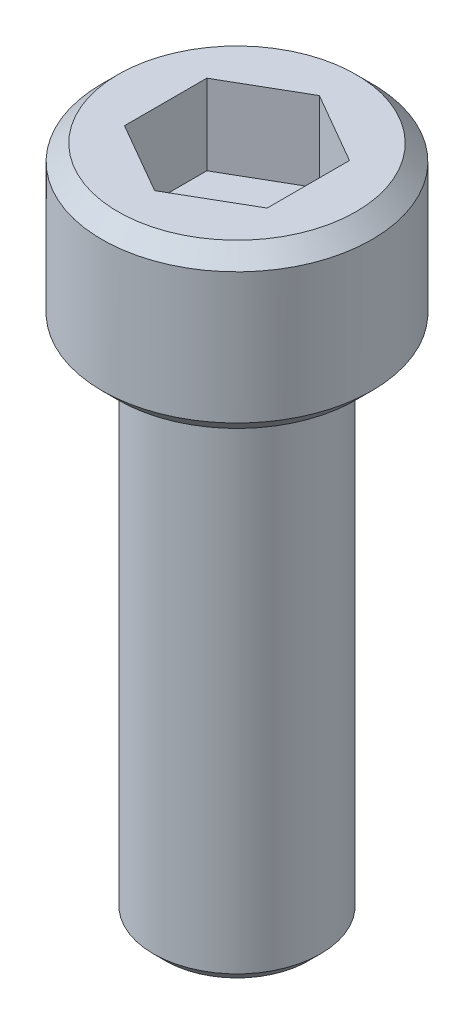
ISO-10303-21;
HEADER;
FILE_DESCRIPTION(('STEP AP214'),'2;1');
FILE_NAME('part.step','',(''),(''),'','','');
FILE_SCHEMA(('AUTOMOTIVE_DESIGN { 1 0 10303 214 1 1 1 1 }'));
ENDSEC;
DATA;
#1=APPLICATION_CONTEXT('core data for automotive mechanical design processes');
#2=APPLICATION_PROTOCOL_DEFINITION('international standard','automotive_design',2000,#1);
#3=PRODUCT_CONTEXT('',#1,'mechanical');
#4=PRODUCT('Part','Part','',(#3));
#5=PRODUCT_RELATED_PRODUCT_CATEGORY('part','',(#4));
#6=PRODUCT_DEFINITION_FORMATION('','',#4);
#7=PRODUCT_DEFINITION_CONTEXT('part definition',#1,'design');
#8=PRODUCT_DEFINITION('design','',#6,#7);
#9=PRODUCT_DEFINITION_SHAPE('','',#8);
#10=(LENGTH_UNIT() NAMED_UNIT(*) SI_UNIT(.MILLI.,.METRE.));
#11=(NAMED_UNIT(*) PLANE_ANGLE_UNIT() SI_UNIT($,.RADIAN.));
#12=(NAMED_UNIT(*) SI_UNIT($,.STERADIAN.) SOLID_ANGLE_UNIT());
#13=UNCERTAINTY_MEASURE_WITH_UNIT(LENGTH_MEASURE(1.E-05),#10,'distance_accuracy_value','');
#14=(GEOMETRIC_REPRESENTATION_CONTEXT(3) GLOBAL_UNCERTAINTY_ASSIGNED_CONTEXT((#13)) GLOBAL_UNIT_ASSIGNED_CONTEXT((#10,
#11,#12)) REPRESENTATION_CONTEXT('',''));
#15=CARTESIAN_POINT('',(0.,0.,0.));
#16=DIRECTION('',(0.,0.,1.));
#17=DIRECTION('',(1.,0.,0.));
#18=AXIS2_PLACEMENT_3D('',#15,#16,#17);
#19=CARTESIAN_POINT('',(1.778,2.06400000000001,3.07958633585748));
#20=DIRECTION('',(0.,1.,0.));
#21=DIRECTION('',(-1.,0.,0.));
#22=AXIS2_PLACEMENT_3D('',#19,#20,#21);
#23=PLANE('',#22);
#24=DIRECTION('',(-0.866025403784439,0.,0.5));
#25=VECTOR('',#24,1.);
#26=CARTESIAN_POINT('',(0.,2.06400000000001,-2.0530575572383));
#27=LINE('',#26,#25);
#28=CARTESIAN_POINT('',(0.,2.06400000000001,-2.0530575572383));
#29=VERTEX_POINT('',#28);
#30=CARTESIAN_POINT('',(-1.778,2.06400000000001,-1.02652877861914));
#31=VERTEX_POINT('',#30);
#32=EDGE_CURVE('E68',#29,#31,#27,.T.);
#33=ORIENTED_EDGE('',*,*,#32,.T.);
#34=DIRECTION('',(0.,0.,1.));
#35=VECTOR('',#34,1.);
#36=CARTESIAN_POINT('',(-1.778,2.06400000000001,-1.02652877861914));
#37=LINE('',#36,#35);
#38=CARTESIAN_POINT('',(-1.778,2.06400000000001,1.02652877861916));
#39=VERTEX_POINT('',#38);
#40=EDGE_CURVE('E70',#31,#39,#37,.T.);
#41=ORIENTED_EDGE('',*,*,#40,.T.);
#42=DIRECTION('',(0.866025403784439,0.,0.499999999999999));
#43=VECTOR('',#42,1.);
#44=CARTESIAN_POINT('',(-1.77799999999999,2.06400000000001,1.02652877861916));
#45=LINE('',#44,#43);
#46=CARTESIAN_POINT('',(0.,2.06400000000001,2.05305755723832));
#47=VERTEX_POINT('',#46);
#48=EDGE_CURVE('E72',#39,#47,#45,.T.);
#49=ORIENTED_EDGE('',*,*,#48,.T.);
#50=DIRECTION('',(0.866025403784438,0.,-0.500000000000001));
#51=VECTOR('',#50,1.);
#52=CARTESIAN_POINT('',(0.,2.06400000000001,2.05305755723831));
#53=LINE('',#52,#51);
#54=CARTESIAN_POINT('',(1.778,2.06400000000001,1.02652877861917));
#55=VERTEX_POINT('',#54);
#56=EDGE_CURVE('E127',#47,#55,#53,.T.);
#57=ORIENTED_EDGE('',*,*,#56,.T.);
#58=DIRECTION('',(0.,0.,-1.));
#59=VECTOR('',#58,1.);
#60=CARTESIAN_POINT('',(1.778,2.06400000000001,1.02652877861917));
#61=LINE('',#60,#59);
#62=CARTESIAN_POINT('',(1.778,2.06400000000001,-1.02652877861914));
#63=VERTEX_POINT('',#62);
#64=EDGE_CURVE('E132',#55,#63,#61,.T.);
#65=ORIENTED_EDGE('',*,*,#64,.T.);
#66=DIRECTION('',(-0.866025403784439,0.,-0.499999999999999));
#67=VECTOR('',#66,1.);
#68=CARTESIAN_POINT('',(1.77800000000001,2.06400000000001,-1.02652877861914));
#69=LINE('',#68,#67);
#70=EDGE_CURVE('E136',#63,#29,#69,.T.);
#71=ORIENTED_EDGE('',*,*,#70,.T.);
#72=EDGE_LOOP('',(#33,#41,#49,#57,#65,#71));
#73=FACE_BOUND('',#72,.T.);
#74=ADVANCED_FACE('F17',(#73),#23,.T.);
#75=CARTESIAN_POINT('',(-1.77799999999999,2.06400000000001,1.02652877861916));
#76=DIRECTION('',(-0.499999999999999,0.,0.866025403784439));
#77=DIRECTION('',(0.866025403784439,0.,0.499999999999999));
#78=AXIS2_PLACEMENT_3D('',#75,#76,#77);
#79=PLANE('',#78);
#80=DIRECTION('',(0.,1.,0.));
#81=VECTOR('',#80,1.);
#82=CARTESIAN_POINT('',(0.,2.06400000000001,2.05305755723832));
#83=LINE('',#82,#81);
#84=CARTESIAN_POINT('',(0.,4.06400000000001,2.05305755723832));
#85=VERTEX_POINT('',#84);
#86=EDGE_CURVE('E83',#85,#47,#83,.F.);
#87=ORIENTED_EDGE('',*,*,#86,.T.);
#88=ORIENTED_EDGE('',*,*,#48,.F.);
#89=DIRECTION('',(0.,1.,0.));
#90=VECTOR('',#89,1.);
#91=CARTESIAN_POINT('',(-1.778,2.06400000000001,1.02652877861916));
#92=LINE('',#91,#90);
#93=CARTESIAN_POINT('',(-1.778,4.06400000000001,1.02652877861916));
#94=VERTEX_POINT('',#93);
#95=EDGE_CURVE('E77',#39,#94,#92,.T.);
#96=ORIENTED_EDGE('',*,*,#95,.T.);
#97=DIRECTION('',(-0.86602540378444,0.,-0.499999999999998));
#98=VECTOR('',#97,1.);
#99=CARTESIAN_POINT('',(0.,4.06400000000001,2.05305755723831));
#100=LINE('',#99,#98);
#101=EDGE_CURVE('E124',#85,#94,#100,.T.);
#102=ORIENTED_EDGE('',*,*,#101,.F.);
#103=EDGE_LOOP('',(#87,#88,#96,#102));
#104=FACE_BOUND('',#103,.T.);
#105=ADVANCED_FACE('F80',(#104),#79,.F.);
#106=CARTESIAN_POINT('',(-1.778,2.06400000000001,-1.02652877861914));
#107=DIRECTION('',(-1.,0.,0.));
#108=DIRECTION('',(0.,0.,1.));
#109=AXIS2_PLACEMENT_3D('',#106,#107,#108);
#110=PLANE('',#109);
#111=ORIENTED_EDGE('',*,*,#95,.F.);
#112=ORIENTED_EDGE('',*,*,#40,.F.);
#113=DIRECTION('',(0.,1.,0.));
#114=VECTOR('',#113,1.);
#115=CARTESIAN_POINT('',(-1.778,2.06400000000001,-1.02652877861914));
#116=LINE('',#115,#114);
#117=CARTESIAN_POINT('',(-1.778,4.06400000000001,-1.02652877861914));
#118=VERTEX_POINT('',#117);
#119=EDGE_CURVE('E91',#31,#118,#116,.T.);
#120=ORIENTED_EDGE('',*,*,#119,.T.);
#121=DIRECTION('',(0.,0.,1.));
#122=VECTOR('',#121,1.);
#123=CARTESIAN_POINT('',(-1.778,4.06400000000001,0.));
#124=LINE('',#123,#122);
#125=EDGE_CURVE('E88',#94,#118,#124,.F.);
#126=ORIENTED_EDGE('',*,*,#125,.F.);
#127=EDGE_LOOP('',(#111,#112,#120,#126));
#128=FACE_BOUND('',#127,.T.);
#129=ADVANCED_FACE('F86',(#128),#110,.F.);
#130=CARTESIAN_POINT('',(0.,2.06400000000001,-2.0530575572383));
#131=DIRECTION('',(-0.5,0.,-0.866025403784439));
#132=DIRECTION('',(-0.866025403784439,0.,0.5));
#133=AXIS2_PLACEMENT_3D('',#130,#131,#132);
#134=PLANE('',#133);
#135=ORIENTED_EDGE('',*,*,#119,.F.);
#136=ORIENTED_EDGE('',*,*,#32,.F.);
#137=DIRECTION('',(0.,1.,0.));
#138=VECTOR('',#137,1.);
#139=CARTESIAN_POINT('',(0.,2.06400000000001,-2.0530575572383));
#140=LINE('',#139,#138);
#141=CARTESIAN_POINT('',(0.,4.06400000000001,-2.05305755723829));
#142=VERTEX_POINT('',#141);
#143=EDGE_CURVE('E134',#29,#142,#140,.T.);
#144=ORIENTED_EDGE('',*,*,#143,.T.);
#145=DIRECTION('',(0.866025403784438,0.,-0.500000000000001));
#146=VECTOR('',#145,1.);
#147=CARTESIAN_POINT('',(-1.778,4.06400000000001,-1.02652877861914));
#148=LINE('',#147,#146);
#149=EDGE_CURVE('E120',#118,#142,#148,.T.);
#150=ORIENTED_EDGE('',*,*,#149,.F.);
#151=EDGE_LOOP('',(#135,#136,#144,#150));
#152=FACE_BOUND('',#151,.T.);
#153=ADVANCED_FACE('F139',(#152),#134,.F.);
#154=CARTESIAN_POINT('',(1.77800000000001,2.06400000000001,-1.02652877861914));
#155=DIRECTION('',(0.499999999999999,0.,-0.866025403784439));
#156=DIRECTION('',(-0.866025403784439,0.,-0.499999999999999));
#157=AXIS2_PLACEMENT_3D('',#154,#155,#156);
#158=PLANE('',#157);
#159=ORIENTED_EDGE('',*,*,#143,.F.);
#160=ORIENTED_EDGE('',*,*,#70,.F.);
#161=DIRECTION('',(0.,1.,0.));
#162=VECTOR('',#161,1.);
#163=CARTESIAN_POINT('',(1.778,2.06400000000001,-1.02652877861914));
#164=LINE('',#163,#162);
#165=CARTESIAN_POINT('',(1.778,4.06400000000001,-1.02652877861914));
#166=VERTEX_POINT('',#165);
#167=EDGE_CURVE('E130',#63,#166,#164,.T.);
#168=ORIENTED_EDGE('',*,*,#167,.T.);
#169=DIRECTION('',(0.866025403784439,0.,0.499999999999999));
#170=VECTOR('',#169,1.);
#171=CARTESIAN_POINT('',(0.,4.06400000000001,-2.0530575572383));
#172=LINE('',#171,#170);
#173=EDGE_CURVE('E117',#142,#166,#172,.T.);
#174=ORIENTED_EDGE('',*,*,#173,.F.);
#175=EDGE_LOOP('',(#159,#160,#168,#174));
#176=FACE_BOUND('',#175,.T.);
#177=ADVANCED_FACE('F151',(#176),#158,.F.);
#178=CARTESIAN_POINT('',(1.778,2.06400000000001,1.02652877861917));
#179=DIRECTION('',(1.,0.,0.));
#180=DIRECTION('',(0.,0.,-1.));
#181=AXIS2_PLACEMENT_3D('',#178,#179,#180);
#182=PLANE('',#181);
#183=ORIENTED_EDGE('',*,*,#167,.F.);
#184=ORIENTED_EDGE('',*,*,#64,.F.);
#185=DIRECTION('',(0.,1.,0.));
#186=VECTOR('',#185,1.);
#187=CARTESIAN_POINT('',(1.778,2.06400000000001,1.02652877861916));
#188=LINE('',#187,#186);
#189=CARTESIAN_POINT('',(1.778,4.06400000000001,1.02652877861917));
#190=VERTEX_POINT('',#189);
#191=EDGE_CURVE('E35',#55,#190,#188,.T.);
#192=ORIENTED_EDGE('',*,*,#191,.T.);
#193=DIRECTION('',(0.,0.,1.));
#194=VECTOR('',#193,1.);
#195=CARTESIAN_POINT('',(1.778,4.06400000000001,0.));
#196=LINE('',#195,#194);
#197=EDGE_CURVE('E114',#166,#190,#196,.T.);
#198=ORIENTED_EDGE('',*,*,#197,.F.);
#199=EDGE_LOOP('',(#183,#184,#192,#198));
#200=FACE_BOUND('',#199,.T.);
#201=ADVANCED_FACE('F149',(#200),#182,.F.);
#202=CARTESIAN_POINT('',(0.,2.06400000000001,2.05305755723831));
#203=DIRECTION('',(0.500000000000001,0.,0.866025403784438));
#204=DIRECTION('',(0.866025403784438,0.,-0.500000000000001));
#205=AXIS2_PLACEMENT_3D('',#202,#203,#204);
#206=PLANE('',#205);
#207=ORIENTED_EDGE('',*,*,#191,.F.);
#208=ORIENTED_EDGE('',*,*,#56,.F.);
#209=ORIENTED_EDGE('',*,*,#86,.F.);
#210=DIRECTION('',(-0.866025403784441,0.,0.499999999999996));
#211=VECTOR('',#210,1.);
#212=CARTESIAN_POINT('',(1.778,4.06400000000001,1.02652877861917));
#213=LINE('',#212,#211);
#214=EDGE_CURVE('E111',#190,#85,#213,.T.);
#215=ORIENTED_EDGE('',*,*,#214,.F.);
#216=EDGE_LOOP('',(#207,#208,#209,#215));
#217=FACE_BOUND('',#216,.T.);
#218=ADVANCED_FACE('F146',(#217),#206,.F.);
#219=CARTESIAN_POINT('',(0.,4.06400000000001,0.));
#220=DIRECTION('',(0.,1.,0.));
#221=DIRECTION('',(-1.,0.,0.));
#222=AXIS2_PLACEMENT_3D('',#219,#220,#221);
#223=PLANE('',#222);
#224=ORIENTED_EDGE('',*,*,#197,.T.);
#225=ORIENTED_EDGE('',*,*,#214,.T.);
#226=ORIENTED_EDGE('',*,*,#101,.T.);
#227=ORIENTED_EDGE('',*,*,#125,.T.);
#228=ORIENTED_EDGE('',*,*,#149,.T.);
#229=ORIENTED_EDGE('',*,*,#173,.T.);
#230=EDGE_LOOP('',(#224,#225,#226,#227,#228,#229));
#231=FACE_BOUND('',#230,.T.);
#232=CARTESIAN_POINT('',(0.,4.06400000002805,0.));
#233=DIRECTION('',(0.,-1.,0.));
#234=DIRECTION('',(1.,0.,0.));
#235=AXIS2_PLACEMENT_3D('',#232,#233,#234);
#236=CIRCLE('',#235,2.96550000001617);
#237=CARTESIAN_POINT('',(2.96550000001617,4.06400000002805,0.));
#238=VERTEX_POINT('',#237);
#239=EDGE_CURVE('E20',#238,#238,#236,.T.);
#240=ORIENTED_EDGE('',*,*,#239,.F.);
#241=EDGE_LOOP('',(#240));
#242=FACE_BOUND('',#241,.T.);
#243=ADVANCED_FACE('F143',(#231,#242),#223,.T.);
#244=CARTESIAN_POINT('',(0.,3.66400000007161,0.));
#245=DIRECTION('',(0.,-1.,0.));
#246=DIRECTION('',(1.,0.,0.));
#247=AXIS2_PLACEMENT_3D('',#244,#245,#246);
#248=CONICAL_SURFACE('',#247,3.36549999991577,0.785398163326394);
#249=ORIENTED_EDGE('',*,*,#239,.T.);
#250=EDGE_LOOP('',(#249));
#251=FACE_BOUND('',#250,.T.);
#252=CARTESIAN_POINT('',(0.,3.664,0.));
#253=DIRECTION('',(0.,-1.,0.));
#254=DIRECTION('',(1.,0.,0.));
#255=AXIS2_PLACEMENT_3D('',#252,#253,#254);
#256=CIRCLE('',#255,3.3655);
#257=CARTESIAN_POINT('',(3.3655,3.664,0.));
#258=VERTEX_POINT('',#257);
#259=EDGE_CURVE('E103',#258,#258,#256,.T.);
#260=ORIENTED_EDGE('',*,*,#259,.F.);
#261=EDGE_LOOP('',(#260));
#262=FACE_BOUND('',#261,.T.);
#263=ADVANCED_FACE('F188',(#251,#262),#248,.T.);
#264=CARTESIAN_POINT('',(0.,4.06400000000001,0.));
#265=DIRECTION('',(0.,-1.,0.));
#266=DIRECTION('',(1.,0.,0.));
#267=AXIS2_PLACEMENT_3D('',#264,#265,#266);
#268=CYLINDRICAL_SURFACE('',#267,3.3655);
#269=ORIENTED_EDGE('',*,*,#259,.T.);
#270=EDGE_LOOP('',(#269));
#271=FACE_BOUND('',#270,.T.);
#272=CARTESIAN_POINT('',(0.,0.400000000013279,0.));
#273=DIRECTION('',(0.,1.,0.));
#274=DIRECTION('',(0.,0.,1.));
#275=AXIS2_PLACEMENT_3D('',#272,#273,#274);
#276=CIRCLE('',#275,3.36549999997258);
#277=CARTESIAN_POINT('',(0.,0.400000000013279,3.3654999999726));
#278=VERTEX_POINT('',#277);
#279=EDGE_CURVE('E99',#278,#278,#276,.F.);
#280=ORIENTED_EDGE('',*,*,#279,.F.);
#281=EDGE_LOOP('',(#280));
#282=FACE_BOUND('',#281,.T.);
#283=ADVANCED_FACE('F184',(#271,#282),#268,.T.);
#284=CARTESIAN_POINT('',(0.,-12.7,0.));
#285=DIRECTION('',(0.,1.,0.));
#286=DIRECTION('',(-1.,0.,0.));
#287=AXIS2_PLACEMENT_3D('',#284,#285,#286);
#288=PLANE('',#287);
#289=CARTESIAN_POINT('',(0.,-12.6999999999953,0.));
#290=DIRECTION('',(0.,1.,0.));
#291=DIRECTION('',(-1.,0.,0.));
#292=AXIS2_PLACEMENT_3D('',#289,#290,#291);
#293=CIRCLE('',#292,1.7828000000577);
#294=CARTESIAN_POINT('',(-1.7828000000577,-12.6999999999953,0.));
#295=VERTEX_POINT('',#294);
#296=EDGE_CURVE('E97',#295,#295,#293,.T.);
#297=ORIENTED_EDGE('',*,*,#296,.F.);
#298=EDGE_LOOP('',(#297));
#299=FACE_BOUND('',#298,.T.);
#300=ADVANCED_FACE('F180',(#299),#288,.F.);
#301=CARTESIAN_POINT('',(0.,0.400000000126965,0.));
#302=DIRECTION('',(0.,1.,0.));
#303=DIRECTION('',(0.,0.,1.));
#304=AXIS2_PLACEMENT_3D('',#301,#302,#303);
#305=CONICAL_SURFACE('',#304,3.36550000008627,0.785398163397448);
#306=CARTESIAN_POINT('',(0.,5.6843418860808E-11,0.));
#307=DIRECTION('',(0.,1.,0.));
#308=DIRECTION('',(0.,0.,1.));
#309=AXIS2_PLACEMENT_3D('',#306,#307,#308);
#310=CIRCLE('',#309,2.96550000001615);
#311=CARTESIAN_POINT('',(0.,5.6843418860808E-11,2.96550000001616));
#312=VERTEX_POINT('',#311);
#313=EDGE_CURVE('E95',#312,#312,#310,.T.);
#314=ORIENTED_EDGE('',*,*,#313,.T.);
#315=EDGE_LOOP('',(#314));
#316=FACE_BOUND('',#315,.T.);
#317=ORIENTED_EDGE('',*,*,#279,.T.);
#318=EDGE_LOOP('',(#317));
#319=FACE_BOUND('',#318,.T.);
#320=ADVANCED_FACE('F176',(#316,#319),#305,.T.);
#321=CARTESIAN_POINT('',(0.,-12.4000000000137,0.));
#322=DIRECTION('',(0.,1.,0.));
#323=DIRECTION('',(-1.,0.,0.));
#324=AXIS2_PLACEMENT_3D('',#321,#322,#323);
#325=CONICAL_SURFACE('',#324,2.08280000003924,0.785398163397448);
#326=CARTESIAN_POINT('',(0.,-12.4,0.));
#327=DIRECTION('',(0.,1.,0.));
#328=DIRECTION('',(-1.,0.,0.));
#329=AXIS2_PLACEMENT_3D('',#326,#327,#328);
#330=CIRCLE('',#329,2.0828);
#331=CARTESIAN_POINT('',(-2.0828,-12.4,0.));
#332=VERTEX_POINT('',#331);
#333=EDGE_CURVE('E26',#332,#332,#330,.T.);
#334=ORIENTED_EDGE('',*,*,#333,.F.);
#335=EDGE_LOOP('',(#334));
#336=FACE_BOUND('',#335,.T.);
#337=ORIENTED_EDGE('',*,*,#296,.T.);
#338=EDGE_LOOP('',(#337));
#339=FACE_BOUND('',#338,.T.);
#340=ADVANCED_FACE('F169',(#336,#339),#325,.T.);
#341=CARTESIAN_POINT('',(0.,0.,0.));
#342=DIRECTION('',(0.,1.,0.));
#343=DIRECTION('',(-1.,0.,0.));
#344=AXIS2_PLACEMENT_3D('',#341,#342,#343);
#345=PLANE('',#344);
#346=CARTESIAN_POINT('',(0.,0.,0.));
#347=DIRECTION('',(0.,1.,0.));
#348=DIRECTION('',(-1.,0.,0.));
#349=AXIS2_PLACEMENT_3D('',#346,#347,#348);
#350=CIRCLE('',#349,2.0828);
#351=CARTESIAN_POINT('',(-2.0828,0.,0.));
#352=VERTEX_POINT('',#351);
#353=EDGE_CURVE('E11',#352,#352,#350,.F.);
#354=ORIENTED_EDGE('',*,*,#353,.F.);
#355=EDGE_LOOP('',(#354));
#356=FACE_BOUND('',#355,.T.);
#357=ORIENTED_EDGE('',*,*,#313,.F.);
#358=EDGE_LOOP('',(#357));
#359=FACE_BOUND('',#358,.T.);
#360=ADVANCED_FACE('F163',(#356,#359),#345,.F.);
#361=CARTESIAN_POINT('',(0.,-12.7,0.));
#362=DIRECTION('',(0.,1.,0.));
#363=DIRECTION('',(-1.,0.,0.));
#364=AXIS2_PLACEMENT_3D('',#361,#362,#363);
#365=CYLINDRICAL_SURFACE('',#364,2.0828);
#366=ORIENTED_EDGE('',*,*,#353,.T.);
#367=EDGE_LOOP('',(#366));
#368=FACE_BOUND('',#367,.T.);
#369=ORIENTED_EDGE('',*,*,#333,.T.);
#370=EDGE_LOOP('',(#369));
#371=FACE_BOUND('',#370,.T.);
#372=ADVANCED_FACE('F161',(#368,#371),#365,.T.);
#373=CLOSED_SHELL('',(#74,#105,#129,#153,#177,#201,#218,#243,#263,#283,#300,#320,#340,#360,#372));
#374=MANIFOLD_SOLID_BREP('B1',#373);
#375=ADVANCED_BREP_SHAPE_REPRESENTATION('',(#18,#374),#14);
#376=SHAPE_DEFINITION_REPRESENTATION(#9,#375);
ENDSEC;
END-ISO-10303-21;
